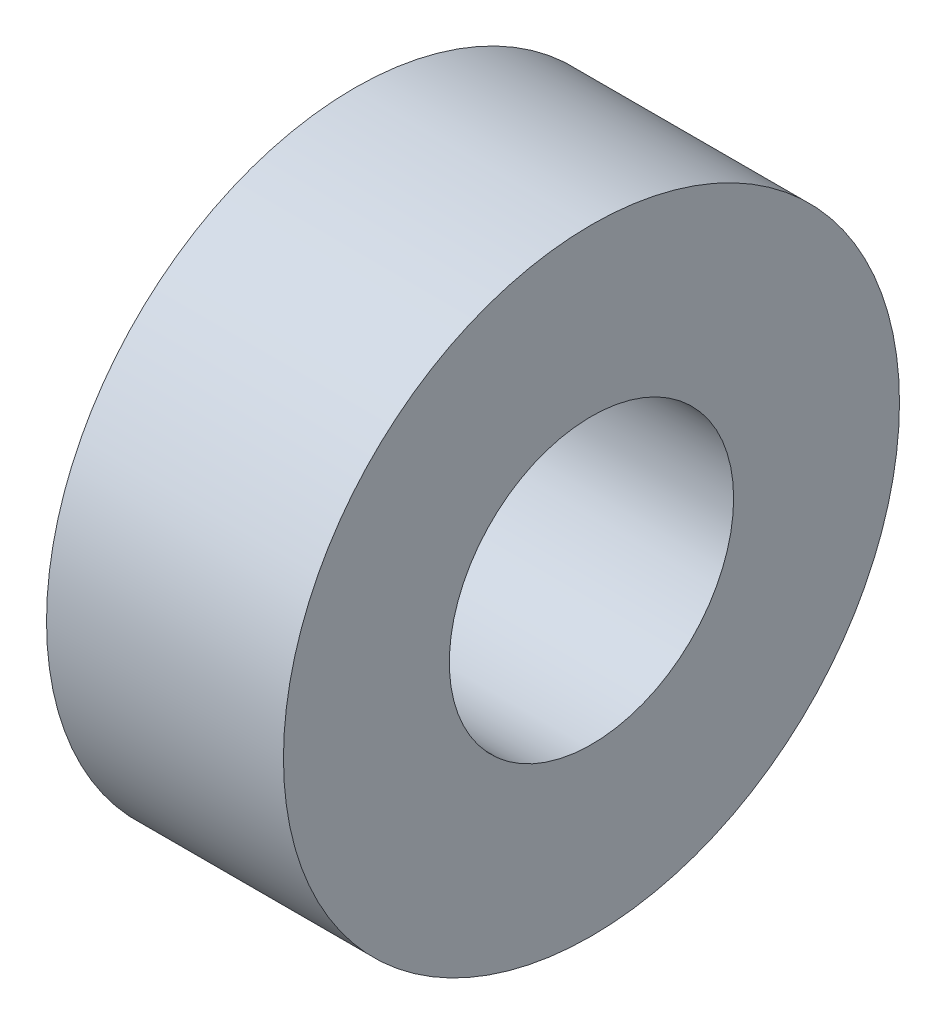
ISO-10303-21;
HEADER;
FILE_DESCRIPTION(('STEP AP214'),'2;1');
FILE_NAME('part.step','',(''),(''),'','','');
FILE_SCHEMA(('AUTOMOTIVE_DESIGN { 1 0 10303 214 1 1 1 1 }'));
ENDSEC;
DATA;
#1=APPLICATION_CONTEXT('core data for automotive mechanical design processes');
#2=APPLICATION_PROTOCOL_DEFINITION('international standard','automotive_design',2000,#1);
#3=PRODUCT_CONTEXT('',#1,'mechanical');
#4=PRODUCT('Part','Part','',(#3));
#5=PRODUCT_RELATED_PRODUCT_CATEGORY('part','',(#4));
#6=PRODUCT_DEFINITION_FORMATION('','',#4);
#7=PRODUCT_DEFINITION_CONTEXT('part definition',#1,'design');
#8=PRODUCT_DEFINITION('design','',#6,#7);
#9=PRODUCT_DEFINITION_SHAPE('','',#8);
#10=(LENGTH_UNIT() NAMED_UNIT(*) SI_UNIT(.MILLI.,.METRE.));
#11=(NAMED_UNIT(*) PLANE_ANGLE_UNIT() SI_UNIT($,.RADIAN.));
#12=(NAMED_UNIT(*) SI_UNIT($,.STERADIAN.) SOLID_ANGLE_UNIT());
#13=UNCERTAINTY_MEASURE_WITH_UNIT(LENGTH_MEASURE(1.E-05),#10,'distance_accuracy_value','');
#14=(GEOMETRIC_REPRESENTATION_CONTEXT(3) GLOBAL_UNCERTAINTY_ASSIGNED_CONTEXT((#13)) GLOBAL_UNIT_ASSIGNED_CONTEXT((#10,
#11,#12)) REPRESENTATION_CONTEXT('',''));
#15=CARTESIAN_POINT('',(0.,0.,0.));
#16=DIRECTION('',(0.,0.,1.));
#17=DIRECTION('',(1.,0.,0.));
#18=AXIS2_PLACEMENT_3D('',#15,#16,#17);
#19=CARTESIAN_POINT('',(5.,0.,0.));
#20=DIRECTION('',(1.,0.,0.));
#21=DIRECTION('',(0.,0.,-1.));
#22=AXIS2_PLACEMENT_3D('',#19,#20,#21);
#23=PLANE('',#22);
#24=CARTESIAN_POINT('',(5.,0.,0.));
#25=DIRECTION('',(1.,0.,0.));
#26=DIRECTION('',(0.,0.,-1.));
#27=AXIS2_PLACEMENT_3D('',#24,#25,#26);
#28=CIRCLE('',#27,6.5);
#29=CARTESIAN_POINT('',(5.,0.,-6.5));
#30=VERTEX_POINT('',#29);
#31=EDGE_CURVE('E10',#30,#30,#28,.T.);
#32=ORIENTED_EDGE('',*,*,#31,.T.);
#33=EDGE_LOOP('',(#32));
#34=FACE_BOUND('',#33,.T.);
#35=CARTESIAN_POINT('',(5.,0.,0.));
#36=DIRECTION('',(1.,0.,0.));
#37=DIRECTION('',(0.,0.,-1.));
#38=AXIS2_PLACEMENT_3D('',#35,#36,#37);
#39=CIRCLE('',#38,3.);
#40=CARTESIAN_POINT('',(5.,0.,-3.));
#41=VERTEX_POINT('',#40);
#42=EDGE_CURVE('E44',#41,#41,#39,.T.);
#43=ORIENTED_EDGE('',*,*,#42,.F.);
#44=EDGE_LOOP('',(#43));
#45=FACE_BOUND('',#44,.T.);
#46=ADVANCED_FACE('F33',(#34,#45),#23,.T.);
#47=CARTESIAN_POINT('',(0.,0.,0.));
#48=DIRECTION('',(1.,0.,0.));
#49=DIRECTION('',(0.,0.,-1.));
#50=AXIS2_PLACEMENT_3D('',#47,#48,#49);
#51=PLANE('',#50);
#52=CARTESIAN_POINT('',(0.,0.,0.));
#53=DIRECTION('',(1.,0.,0.));
#54=DIRECTION('',(0.,0.,-1.));
#55=AXIS2_PLACEMENT_3D('',#52,#53,#54);
#56=CIRCLE('',#55,6.5);
#57=CARTESIAN_POINT('',(0.,0.,-6.5));
#58=VERTEX_POINT('',#57);
#59=EDGE_CURVE('E37',#58,#58,#56,.T.);
#60=ORIENTED_EDGE('',*,*,#59,.F.);
#61=EDGE_LOOP('',(#60));
#62=FACE_BOUND('',#61,.T.);
#63=CARTESIAN_POINT('',(0.,0.,0.));
#64=DIRECTION('',(1.,0.,0.));
#65=DIRECTION('',(0.,0.,-1.));
#66=AXIS2_PLACEMENT_3D('',#63,#64,#65);
#67=CIRCLE('',#66,3.);
#68=CARTESIAN_POINT('',(0.,0.,-3.));
#69=VERTEX_POINT('',#68);
#70=EDGE_CURVE('E46',#69,#69,#67,.T.);
#71=ORIENTED_EDGE('',*,*,#70,.T.);
#72=EDGE_LOOP('',(#71));
#73=FACE_BOUND('',#72,.T.);
#74=ADVANCED_FACE('F56',(#62,#73),#51,.F.);
#75=CARTESIAN_POINT('',(5.,0.,0.));
#76=DIRECTION('',(-1.,0.,0.));
#77=DIRECTION('',(0.,0.,1.));
#78=AXIS2_PLACEMENT_3D('',#75,#76,#77);
#79=CYLINDRICAL_SURFACE('',#78,6.5);
#80=ORIENTED_EDGE('',*,*,#31,.F.);
#81=EDGE_LOOP('',(#80));
#82=FACE_BOUND('',#81,.T.);
#83=ORIENTED_EDGE('',*,*,#59,.T.);
#84=EDGE_LOOP('',(#83));
#85=FACE_BOUND('',#84,.T.);
#86=ADVANCED_FACE('F35',(#82,#85),#79,.T.);
#87=CARTESIAN_POINT('',(5.,0.,0.));
#88=DIRECTION('',(-1.,0.,0.));
#89=DIRECTION('',(0.,0.,1.));
#90=AXIS2_PLACEMENT_3D('',#87,#88,#89);
#91=CYLINDRICAL_SURFACE('',#90,3.);
#92=ORIENTED_EDGE('',*,*,#42,.T.);
#93=EDGE_LOOP('',(#92));
#94=FACE_BOUND('',#93,.T.);
#95=ORIENTED_EDGE('',*,*,#70,.F.);
#96=EDGE_LOOP('',(#95));
#97=FACE_BOUND('',#96,.T.);
#98=ADVANCED_FACE('F52',(#94,#97),#91,.F.);
#99=CLOSED_SHELL('',(#46,#74,#86,#98));
#100=MANIFOLD_SOLID_BREP('B2',#99);
#101=ADVANCED_BREP_SHAPE_REPRESENTATION('',(#18,#100),#14);
#102=SHAPE_DEFINITION_REPRESENTATION(#9,#101);
ENDSEC;
END-ISO-10303-21;
